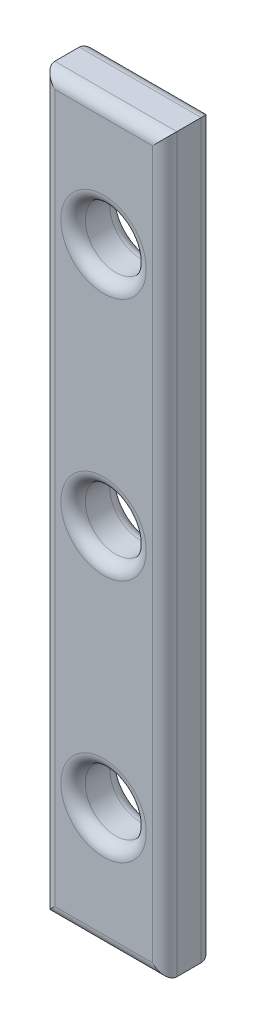
ISO-10303-21;
HEADER;
FILE_DESCRIPTION(('STEP AP214'),'2;1');
FILE_NAME('part.step','',(''),(''),'','','');
FILE_SCHEMA(('AUTOMOTIVE_DESIGN { 1 0 10303 214 1 1 1 1 }'));
ENDSEC;
DATA;
#1=APPLICATION_CONTEXT('core data for automotive mechanical design processes');
#2=APPLICATION_PROTOCOL_DEFINITION('international standard','automotive_design',2000,#1);
#3=PRODUCT_CONTEXT('',#1,'mechanical');
#4=PRODUCT('Part','Part','',(#3));
#5=PRODUCT_RELATED_PRODUCT_CATEGORY('part','',(#4));
#6=PRODUCT_DEFINITION_FORMATION('','',#4);
#7=PRODUCT_DEFINITION_CONTEXT('part definition',#1,'design');
#8=PRODUCT_DEFINITION('design','',#6,#7);
#9=PRODUCT_DEFINITION_SHAPE('','',#8);
#10=(LENGTH_UNIT() NAMED_UNIT(*) SI_UNIT(.MILLI.,.METRE.));
#11=(NAMED_UNIT(*) PLANE_ANGLE_UNIT() SI_UNIT($,.RADIAN.));
#12=(NAMED_UNIT(*) SI_UNIT($,.STERADIAN.) SOLID_ANGLE_UNIT());
#13=UNCERTAINTY_MEASURE_WITH_UNIT(LENGTH_MEASURE(1.E-05),#10,'distance_accuracy_value','');
#14=(GEOMETRIC_REPRESENTATION_CONTEXT(3) GLOBAL_UNCERTAINTY_ASSIGNED_CONTEXT((#13)) GLOBAL_UNIT_ASSIGNED_CONTEXT((#10,
#11,#12)) REPRESENTATION_CONTEXT('',''));
#15=CARTESIAN_POINT('',(0.,0.,0.));
#16=DIRECTION('',(0.,0.,1.));
#17=DIRECTION('',(1.,0.,0.));
#18=AXIS2_PLACEMENT_3D('',#15,#16,#17);
#19=CARTESIAN_POINT('',(0.,0.,4.));
#20=DIRECTION('',(0.,0.,-1.));
#21=DIRECTION('',(-1.,0.,0.));
#22=AXIS2_PLACEMENT_3D('',#19,#20,#21);
#23=PLANE('',#22);
#24=CARTESIAN_POINT('',(5.,30.,4.));
#25=DIRECTION('',(0.,0.,-1.));
#26=DIRECTION('',(-1.,0.,0.));
#27=AXIS2_PLACEMENT_3D('',#24,#25,#26);
#28=CIRCLE('',#27,3.5);
#29=CARTESIAN_POINT('',(1.5,30.,4.));
#30=VERTEX_POINT('',#29);
#31=EDGE_CURVE('E204',#30,#30,#28,.T.);
#32=ORIENTED_EDGE('',*,*,#31,.T.);
#33=EDGE_LOOP('',(#32));
#34=FACE_BOUND('',#33,.T.);
#35=CARTESIAN_POINT('',(5.,10.,4.));
#36=DIRECTION('',(0.,0.,-1.));
#37=DIRECTION('',(-1.,0.,0.));
#38=AXIS2_PLACEMENT_3D('',#35,#36,#37);
#39=CIRCLE('',#38,3.5);
#40=CARTESIAN_POINT('',(1.5,10.,4.));
#41=VERTEX_POINT('',#40);
#42=EDGE_CURVE('E200',#41,#41,#39,.T.);
#43=ORIENTED_EDGE('',*,*,#42,.T.);
#44=EDGE_LOOP('',(#43));
#45=FACE_BOUND('',#44,.T.);
#46=CARTESIAN_POINT('',(5.,50.,4.));
#47=DIRECTION('',(0.,0.,-1.));
#48=DIRECTION('',(-1.,0.,0.));
#49=AXIS2_PLACEMENT_3D('',#46,#47,#48);
#50=CIRCLE('',#49,3.5);
#51=CARTESIAN_POINT('',(1.5,50.,4.));
#52=VERTEX_POINT('',#51);
#53=EDGE_CURVE('E196',#52,#52,#50,.T.);
#54=ORIENTED_EDGE('',*,*,#53,.T.);
#55=EDGE_LOOP('',(#54));
#56=FACE_BOUND('',#55,.T.);
#57=DIRECTION('',(0.,-1.,0.));
#58=VECTOR('',#57,1.);
#59=CARTESIAN_POINT('',(1.,0.,4.));
#60=LINE('',#59,#58);
#61=CARTESIAN_POINT('',(1.,59.,4.));
#62=VERTEX_POINT('',#61);
#63=CARTESIAN_POINT('',(1.,1.,4.));
#64=VERTEX_POINT('',#63);
#65=EDGE_CURVE('E119',#62,#64,#60,.T.);
#66=ORIENTED_EDGE('',*,*,#65,.T.);
#67=DIRECTION('',(1.,0.,0.));
#68=VECTOR('',#67,1.);
#69=CARTESIAN_POINT('',(0.,1.,4.));
#70=LINE('',#69,#68);
#71=CARTESIAN_POINT('',(9.,1.,4.));
#72=VERTEX_POINT('',#71);
#73=EDGE_CURVE('E114',#64,#72,#70,.T.);
#74=ORIENTED_EDGE('',*,*,#73,.T.);
#75=DIRECTION('',(0.,1.,0.));
#76=VECTOR('',#75,1.);
#77=CARTESIAN_POINT('',(9.,0.,4.));
#78=LINE('',#77,#76);
#79=CARTESIAN_POINT('',(9.,59.,4.));
#80=VERTEX_POINT('',#79);
#81=EDGE_CURVE('E110',#72,#80,#78,.T.);
#82=ORIENTED_EDGE('',*,*,#81,.T.);
#83=DIRECTION('',(-1.,0.,0.));
#84=VECTOR('',#83,1.);
#85=CARTESIAN_POINT('',(0.,59.,4.));
#86=LINE('',#85,#84);
#87=EDGE_CURVE('E112',#80,#62,#86,.T.);
#88=ORIENTED_EDGE('',*,*,#87,.T.);
#89=EDGE_LOOP('',(#66,#74,#82,#88));
#90=FACE_BOUND('',#89,.T.);
#91=ADVANCED_FACE('F40',(#34,#45,#56,#90),#23,.F.);
#92=CARTESIAN_POINT('',(0.,0.,0.));
#93=DIRECTION('',(0.,0.,-1.));
#94=DIRECTION('',(-1.,0.,0.));
#95=AXIS2_PLACEMENT_3D('',#92,#93,#94);
#96=PLANE('',#95);
#97=CARTESIAN_POINT('',(5.,30.,0.));
#98=DIRECTION('',(0.,0.,-1.));
#99=DIRECTION('',(-1.,0.,0.));
#100=AXIS2_PLACEMENT_3D('',#97,#98,#99);
#101=CIRCLE('',#100,3.5);
#102=CARTESIAN_POINT('',(1.5,30.,0.));
#103=VERTEX_POINT('',#102);
#104=EDGE_CURVE('E49',#103,#103,#101,.F.);
#105=ORIENTED_EDGE('',*,*,#104,.T.);
#106=EDGE_LOOP('',(#105));
#107=FACE_BOUND('',#106,.T.);
#108=CARTESIAN_POINT('',(5.,50.,0.));
#109=DIRECTION('',(0.,0.,-1.));
#110=DIRECTION('',(-1.,0.,0.));
#111=AXIS2_PLACEMENT_3D('',#108,#109,#110);
#112=CIRCLE('',#111,3.5);
#113=CARTESIAN_POINT('',(1.5,50.,0.));
#114=VERTEX_POINT('',#113);
#115=EDGE_CURVE('E232',#114,#114,#112,.F.);
#116=ORIENTED_EDGE('',*,*,#115,.T.);
#117=EDGE_LOOP('',(#116));
#118=FACE_BOUND('',#117,.T.);
#119=CARTESIAN_POINT('',(5.,10.,0.));
#120=DIRECTION('',(0.,0.,-1.));
#121=DIRECTION('',(-1.,0.,0.));
#122=AXIS2_PLACEMENT_3D('',#119,#120,#121);
#123=CIRCLE('',#122,3.5);
#124=CARTESIAN_POINT('',(1.5,10.,0.));
#125=VERTEX_POINT('',#124);
#126=EDGE_CURVE('E228',#125,#125,#123,.F.);
#127=ORIENTED_EDGE('',*,*,#126,.T.);
#128=EDGE_LOOP('',(#127));
#129=FACE_BOUND('',#128,.T.);
#130=DIRECTION('',(0.,-1.,0.));
#131=VECTOR('',#130,1.);
#132=CARTESIAN_POINT('',(1.,60.,0.));
#133=LINE('',#132,#131);
#134=CARTESIAN_POINT('',(1.,1.,0.));
#135=VERTEX_POINT('',#134);
#136=CARTESIAN_POINT('',(1.,59.,0.));
#137=VERTEX_POINT('',#136);
#138=EDGE_CURVE('E218',#135,#137,#133,.F.);
#139=ORIENTED_EDGE('',*,*,#138,.T.);
#140=DIRECTION('',(-1.,0.,0.));
#141=VECTOR('',#140,1.);
#142=CARTESIAN_POINT('',(10.,59.,0.));
#143=LINE('',#142,#141);
#144=CARTESIAN_POINT('',(9.,59.,0.));
#145=VERTEX_POINT('',#144);
#146=EDGE_CURVE('E224',#137,#145,#143,.F.);
#147=ORIENTED_EDGE('',*,*,#146,.T.);
#148=DIRECTION('',(0.,1.,0.));
#149=VECTOR('',#148,1.);
#150=CARTESIAN_POINT('',(9.,0.,0.));
#151=LINE('',#150,#149);
#152=CARTESIAN_POINT('',(9.,1.,0.));
#153=VERTEX_POINT('',#152);
#154=EDGE_CURVE('E221',#145,#153,#151,.F.);
#155=ORIENTED_EDGE('',*,*,#154,.T.);
#156=DIRECTION('',(1.,0.,0.));
#157=VECTOR('',#156,1.);
#158=CARTESIAN_POINT('',(0.,1.,0.));
#159=LINE('',#158,#157);
#160=EDGE_CURVE('E215',#153,#135,#159,.F.);
#161=ORIENTED_EDGE('',*,*,#160,.T.);
#162=EDGE_LOOP('',(#139,#147,#155,#161));
#163=FACE_BOUND('',#162,.T.);
#164=ADVANCED_FACE('F271',(#107,#118,#129,#163),#96,.T.);
#165=CARTESIAN_POINT('',(0.,0.,4.));
#166=DIRECTION('',(1.,0.,0.));
#167=DIRECTION('',(0.,0.,-1.));
#168=AXIS2_PLACEMENT_3D('',#165,#166,#167);
#169=PLANE('',#168);
#170=DIRECTION('',(0.,0.,-1.));
#171=VECTOR('',#170,1.);
#172=CARTESIAN_POINT('',(0.,60.,4.));
#173=LINE('',#172,#171);
#174=CARTESIAN_POINT('',(0.,60.,3.));
#175=VERTEX_POINT('',#174);
#176=CARTESIAN_POINT('',(0.,60.,1.));
#177=VERTEX_POINT('',#176);
#178=EDGE_CURVE('E173',#175,#177,#173,.T.);
#179=ORIENTED_EDGE('',*,*,#178,.T.);
#180=DIRECTION('',(0.,-1.,0.));
#181=VECTOR('',#180,1.);
#182=CARTESIAN_POINT('',(0.,0.,1.));
#183=LINE('',#182,#181);
#184=CARTESIAN_POINT('',(0.,0.,1.));
#185=VERTEX_POINT('',#184);
#186=EDGE_CURVE('E56',#177,#185,#183,.T.);
#187=ORIENTED_EDGE('',*,*,#186,.T.);
#188=DIRECTION('',(0.,0.,-1.));
#189=VECTOR('',#188,1.);
#190=CARTESIAN_POINT('',(0.,0.,4.));
#191=LINE('',#190,#189);
#192=CARTESIAN_POINT('',(0.,0.,3.));
#193=VERTEX_POINT('',#192);
#194=EDGE_CURVE('E177',#193,#185,#191,.T.);
#195=ORIENTED_EDGE('',*,*,#194,.F.);
#196=DIRECTION('',(0.,-1.,0.));
#197=VECTOR('',#196,1.);
#198=CARTESIAN_POINT('',(0.,0.,3.));
#199=LINE('',#198,#197);
#200=EDGE_CURVE('E180',#193,#175,#199,.F.);
#201=ORIENTED_EDGE('',*,*,#200,.T.);
#202=EDGE_LOOP('',(#179,#187,#195,#201));
#203=FACE_BOUND('',#202,.T.);
#204=ADVANCED_FACE('F179',(#203),#169,.F.);
#205=CARTESIAN_POINT('',(0.,0.,4.));
#206=DIRECTION('',(0.,1.,0.));
#207=DIRECTION('',(0.,0.,1.));
#208=AXIS2_PLACEMENT_3D('',#205,#206,#207);
#209=PLANE('',#208);
#210=ORIENTED_EDGE('',*,*,#194,.T.);
#211=DIRECTION('',(1.,0.,0.));
#212=VECTOR('',#211,1.);
#213=CARTESIAN_POINT('',(10.,0.,1.));
#214=LINE('',#213,#212);
#215=CARTESIAN_POINT('',(10.,0.,1.));
#216=VERTEX_POINT('',#215);
#217=EDGE_CURVE('E146',#185,#216,#214,.T.);
#218=ORIENTED_EDGE('',*,*,#217,.T.);
#219=DIRECTION('',(0.,0.,-1.));
#220=VECTOR('',#219,1.);
#221=CARTESIAN_POINT('',(10.,0.,4.));
#222=LINE('',#221,#220);
#223=CARTESIAN_POINT('',(10.,0.,3.));
#224=VERTEX_POINT('',#223);
#225=EDGE_CURVE('E178',#224,#216,#222,.T.);
#226=ORIENTED_EDGE('',*,*,#225,.F.);
#227=DIRECTION('',(1.,0.,0.));
#228=VECTOR('',#227,1.);
#229=CARTESIAN_POINT('',(0.,0.,3.));
#230=LINE('',#229,#228);
#231=EDGE_CURVE('E150',#224,#193,#230,.F.);
#232=ORIENTED_EDGE('',*,*,#231,.T.);
#233=EDGE_LOOP('',(#210,#218,#226,#232));
#234=FACE_BOUND('',#233,.T.);
#235=ADVANCED_FACE('F176',(#234),#209,.F.);
#236=CARTESIAN_POINT('',(10.,0.,4.));
#237=DIRECTION('',(-1.,0.,0.));
#238=DIRECTION('',(0.,0.,1.));
#239=AXIS2_PLACEMENT_3D('',#236,#237,#238);
#240=PLANE('',#239);
#241=ORIENTED_EDGE('',*,*,#225,.T.);
#242=DIRECTION('',(0.,1.,0.));
#243=VECTOR('',#242,1.);
#244=CARTESIAN_POINT('',(10.,60.,1.));
#245=LINE('',#244,#243);
#246=CARTESIAN_POINT('',(10.,60.,1.));
#247=VERTEX_POINT('',#246);
#248=EDGE_CURVE('E246',#216,#247,#245,.T.);
#249=ORIENTED_EDGE('',*,*,#248,.T.);
#250=DIRECTION('',(0.,0.,-1.));
#251=VECTOR('',#250,1.);
#252=CARTESIAN_POINT('',(10.,60.,4.));
#253=LINE('',#252,#251);
#254=CARTESIAN_POINT('',(10.,60.,3.));
#255=VERTEX_POINT('',#254);
#256=EDGE_CURVE('E188',#255,#247,#253,.T.);
#257=ORIENTED_EDGE('',*,*,#256,.F.);
#258=DIRECTION('',(0.,1.,0.));
#259=VECTOR('',#258,1.);
#260=CARTESIAN_POINT('',(10.,0.,3.));
#261=LINE('',#260,#259);
#262=EDGE_CURVE('E134',#255,#224,#261,.F.);
#263=ORIENTED_EDGE('',*,*,#262,.T.);
#264=EDGE_LOOP('',(#241,#249,#257,#263));
#265=FACE_BOUND('',#264,.T.);
#266=ADVANCED_FACE('F325',(#265),#240,.F.);
#267=CARTESIAN_POINT('',(0.,60.,4.));
#268=DIRECTION('',(0.,-1.,0.));
#269=DIRECTION('',(0.,0.,-1.));
#270=AXIS2_PLACEMENT_3D('',#267,#268,#269);
#271=PLANE('',#270);
#272=ORIENTED_EDGE('',*,*,#256,.T.);
#273=DIRECTION('',(-1.,0.,0.));
#274=VECTOR('',#273,1.);
#275=CARTESIAN_POINT('',(0.,60.,1.));
#276=LINE('',#275,#274);
#277=EDGE_CURVE('E211',#247,#177,#276,.T.);
#278=ORIENTED_EDGE('',*,*,#277,.T.);
#279=ORIENTED_EDGE('',*,*,#178,.F.);
#280=DIRECTION('',(-1.,0.,0.));
#281=VECTOR('',#280,1.);
#282=CARTESIAN_POINT('',(0.,60.,3.));
#283=LINE('',#282,#281);
#284=EDGE_CURVE('E208',#175,#255,#283,.F.);
#285=ORIENTED_EDGE('',*,*,#284,.T.);
#286=EDGE_LOOP('',(#272,#278,#279,#285));
#287=FACE_BOUND('',#286,.T.);
#288=ADVANCED_FACE('F289',(#287),#271,.F.);
#289=CARTESIAN_POINT('',(5.,30.,4.));
#290=DIRECTION('',(0.,0.,-1.));
#291=DIRECTION('',(-1.,0.,0.));
#292=AXIS2_PLACEMENT_3D('',#289,#290,#291);
#293=CYLINDRICAL_SURFACE('',#292,2.5);
#294=CARTESIAN_POINT('',(5.,30.,1.));
#295=DIRECTION('',(0.,0.,-1.));
#296=DIRECTION('',(-1.,0.,0.));
#297=AXIS2_PLACEMENT_3D('',#294,#295,#296);
#298=CIRCLE('',#297,2.5);
#299=CARTESIAN_POINT('',(2.5,30.,1.));
#300=VERTEX_POINT('',#299);
#301=EDGE_CURVE('E11',#300,#300,#298,.T.);
#302=ORIENTED_EDGE('',*,*,#301,.T.);
#303=EDGE_LOOP('',(#302));
#304=FACE_BOUND('',#303,.T.);
#305=CARTESIAN_POINT('',(5.,30.,3.));
#306=DIRECTION('',(0.,0.,-1.));
#307=DIRECTION('',(-1.,0.,0.));
#308=AXIS2_PLACEMENT_3D('',#305,#306,#307);
#309=CIRCLE('',#308,2.5);
#310=CARTESIAN_POINT('',(2.5,30.,3.));
#311=VERTEX_POINT('',#310);
#312=EDGE_CURVE('E131',#311,#311,#309,.F.);
#313=ORIENTED_EDGE('',*,*,#312,.T.);
#314=EDGE_LOOP('',(#313));
#315=FACE_BOUND('',#314,.T.);
#316=ADVANCED_FACE('F320',(#304,#315),#293,.F.);
#317=CARTESIAN_POINT('',(5.,50.,4.));
#318=DIRECTION('',(0.,0.,-1.));
#319=DIRECTION('',(-1.,0.,0.));
#320=AXIS2_PLACEMENT_3D('',#317,#318,#319);
#321=CYLINDRICAL_SURFACE('',#320,2.5);
#322=CARTESIAN_POINT('',(5.,50.,1.));
#323=DIRECTION('',(0.,0.,-1.));
#324=DIRECTION('',(-1.,0.,0.));
#325=AXIS2_PLACEMENT_3D('',#322,#323,#324);
#326=CIRCLE('',#325,2.5);
#327=CARTESIAN_POINT('',(2.5,50.,1.));
#328=VERTEX_POINT('',#327);
#329=EDGE_CURVE('E240',#328,#328,#326,.T.);
#330=ORIENTED_EDGE('',*,*,#329,.T.);
#331=EDGE_LOOP('',(#330));
#332=FACE_BOUND('',#331,.T.);
#333=CARTESIAN_POINT('',(5.,50.,3.));
#334=DIRECTION('',(0.,0.,-1.));
#335=DIRECTION('',(-1.,0.,0.));
#336=AXIS2_PLACEMENT_3D('',#333,#334,#335);
#337=CIRCLE('',#336,2.5);
#338=CARTESIAN_POINT('',(2.5,50.,3.));
#339=VERTEX_POINT('',#338);
#340=EDGE_CURVE('E236',#339,#339,#337,.F.);
#341=ORIENTED_EDGE('',*,*,#340,.T.);
#342=EDGE_LOOP('',(#341));
#343=FACE_BOUND('',#342,.T.);
#344=ADVANCED_FACE('F406',(#332,#343),#321,.F.);
#345=CARTESIAN_POINT('',(5.,10.,4.));
#346=DIRECTION('',(0.,0.,-1.));
#347=DIRECTION('',(-1.,0.,0.));
#348=AXIS2_PLACEMENT_3D('',#345,#346,#347);
#349=CYLINDRICAL_SURFACE('',#348,2.5);
#350=CARTESIAN_POINT('',(5.,10.,1.));
#351=DIRECTION('',(0.,0.,-1.));
#352=DIRECTION('',(-1.,0.,0.));
#353=AXIS2_PLACEMENT_3D('',#350,#351,#352);
#354=CIRCLE('',#353,2.5);
#355=CARTESIAN_POINT('',(2.5,10.,1.));
#356=VERTEX_POINT('',#355);
#357=EDGE_CURVE('E253',#356,#356,#354,.T.);
#358=ORIENTED_EDGE('',*,*,#357,.T.);
#359=EDGE_LOOP('',(#358));
#360=FACE_BOUND('',#359,.T.);
#361=CARTESIAN_POINT('',(5.,10.,3.));
#362=DIRECTION('',(0.,0.,-1.));
#363=DIRECTION('',(-1.,0.,0.));
#364=AXIS2_PLACEMENT_3D('',#361,#362,#363);
#365=CIRCLE('',#364,2.5);
#366=CARTESIAN_POINT('',(2.5,10.,3.));
#367=VERTEX_POINT('',#366);
#368=EDGE_CURVE('E249',#367,#367,#365,.F.);
#369=ORIENTED_EDGE('',*,*,#368,.T.);
#370=EDGE_LOOP('',(#369));
#371=FACE_BOUND('',#370,.T.);
#372=ADVANCED_FACE('F261',(#360,#371),#349,.F.);
#373=CARTESIAN_POINT('',(5.,30.,3.));
#374=DIRECTION('',(0.,0.,-1.));
#375=DIRECTION('',(-1.,0.,0.));
#376=AXIS2_PLACEMENT_3D('',#373,#374,#375);
#377=TOROIDAL_SURFACE('',#376,3.5,1.);
#378=ORIENTED_EDGE('',*,*,#31,.F.);
#379=EDGE_LOOP('',(#378));
#380=FACE_BOUND('',#379,.T.);
#381=ORIENTED_EDGE('',*,*,#312,.F.);
#382=EDGE_LOOP('',(#381));
#383=FACE_BOUND('',#382,.T.);
#384=ADVANCED_FACE('F302',(#380,#383),#377,.T.);
#385=CARTESIAN_POINT('',(0.,1.,1.));
#386=DIRECTION('',(-1.,0.,0.));
#387=DIRECTION('',(0.,0.,1.));
#388=AXIS2_PLACEMENT_3D('',#385,#386,#387);
#389=CYLINDRICAL_SURFACE('',#388,1.);
#390=CARTESIAN_POINT('',(1.,1.,1.));
#391=DIRECTION('',(-0.707106781186547,0.707106781186547,0.));
#392=DIRECTION('',(-0.707106781186547,-0.707106781186547,0.));
#393=AXIS2_PLACEMENT_3D('',#390,#391,#392);
#394=ELLIPSE('',#393,1.41421356237309,1.);
#395=EDGE_CURVE('E166',#135,#185,#394,.T.);
#396=ORIENTED_EDGE('',*,*,#395,.F.);
#397=ORIENTED_EDGE('',*,*,#160,.F.);
#398=CARTESIAN_POINT('',(9.,1.,1.));
#399=DIRECTION('',(-0.707106781186547,-0.707106781186547,0.));
#400=DIRECTION('',(-0.707106781186547,0.707106781186547,0.));
#401=AXIS2_PLACEMENT_3D('',#398,#399,#400);
#402=ELLIPSE('',#401,1.41421356237309,1.);
#403=EDGE_CURVE('E170',#216,#153,#402,.F.);
#404=ORIENTED_EDGE('',*,*,#403,.F.);
#405=ORIENTED_EDGE('',*,*,#217,.F.);
#406=EDGE_LOOP('',(#396,#397,#404,#405));
#407=FACE_BOUND('',#406,.T.);
#408=ADVANCED_FACE('F300',(#407),#389,.T.);
#409=CARTESIAN_POINT('',(9.,0.,1.));
#410=DIRECTION('',(0.,-1.,0.));
#411=DIRECTION('',(0.,0.,-1.));
#412=AXIS2_PLACEMENT_3D('',#409,#410,#411);
#413=CYLINDRICAL_SURFACE('',#412,1.);
#414=ORIENTED_EDGE('',*,*,#403,.T.);
#415=ORIENTED_EDGE('',*,*,#154,.F.);
#416=CARTESIAN_POINT('',(9.,59.,1.));
#417=DIRECTION('',(0.707106781186547,-0.707106781186547,0.));
#418=DIRECTION('',(-0.707106781186547,-0.707106781186547,0.));
#419=AXIS2_PLACEMENT_3D('',#416,#417,#418);
#420=ELLIPSE('',#419,1.41421356237309,1.);
#421=EDGE_CURVE('E163',#247,#145,#420,.F.);
#422=ORIENTED_EDGE('',*,*,#421,.F.);
#423=ORIENTED_EDGE('',*,*,#248,.F.);
#424=EDGE_LOOP('',(#414,#415,#422,#423));
#425=FACE_BOUND('',#424,.T.);
#426=ADVANCED_FACE('F297',(#425),#413,.T.);
#427=CARTESIAN_POINT('',(1.,0.,1.));
#428=DIRECTION('',(0.,1.,0.));
#429=DIRECTION('',(0.,0.,1.));
#430=AXIS2_PLACEMENT_3D('',#427,#428,#429);
#431=CYLINDRICAL_SURFACE('',#430,1.);
#432=ORIENTED_EDGE('',*,*,#395,.T.);
#433=ORIENTED_EDGE('',*,*,#186,.F.);
#434=CARTESIAN_POINT('',(1.,59.,1.));
#435=DIRECTION('',(0.707106781186547,0.707106781186547,0.));
#436=DIRECTION('',(-0.707106781186547,0.707106781186547,0.));
#437=AXIS2_PLACEMENT_3D('',#434,#435,#436);
#438=ELLIPSE('',#437,1.41421356237309,1.);
#439=EDGE_CURVE('E139',#137,#177,#438,.T.);
#440=ORIENTED_EDGE('',*,*,#439,.F.);
#441=ORIENTED_EDGE('',*,*,#138,.F.);
#442=EDGE_LOOP('',(#432,#433,#440,#441));
#443=FACE_BOUND('',#442,.T.);
#444=ADVANCED_FACE('F286',(#443),#431,.T.);
#445=CARTESIAN_POINT('',(0.,59.,1.));
#446=DIRECTION('',(1.,0.,0.));
#447=DIRECTION('',(0.,0.,-1.));
#448=AXIS2_PLACEMENT_3D('',#445,#446,#447);
#449=CYLINDRICAL_SURFACE('',#448,1.);
#450=ORIENTED_EDGE('',*,*,#421,.T.);
#451=ORIENTED_EDGE('',*,*,#146,.F.);
#452=ORIENTED_EDGE('',*,*,#439,.T.);
#453=ORIENTED_EDGE('',*,*,#277,.F.);
#454=EDGE_LOOP('',(#450,#451,#452,#453));
#455=FACE_BOUND('',#454,.T.);
#456=ADVANCED_FACE('F282',(#455),#449,.T.);
#457=CARTESIAN_POINT('',(5.,50.,1.));
#458=DIRECTION('',(0.,0.,-1.));
#459=DIRECTION('',(-1.,0.,0.));
#460=AXIS2_PLACEMENT_3D('',#457,#458,#459);
#461=TOROIDAL_SURFACE('',#460,3.5,1.);
#462=ORIENTED_EDGE('',*,*,#329,.F.);
#463=EDGE_LOOP('',(#462));
#464=FACE_BOUND('',#463,.T.);
#465=ORIENTED_EDGE('',*,*,#115,.F.);
#466=EDGE_LOOP('',(#465));
#467=FACE_BOUND('',#466,.T.);
#468=ADVANCED_FACE('F267',(#464,#467),#461,.T.);
#469=CARTESIAN_POINT('',(5.,10.,1.));
#470=DIRECTION('',(0.,0.,-1.));
#471=DIRECTION('',(-1.,0.,0.));
#472=AXIS2_PLACEMENT_3D('',#469,#470,#471);
#473=TOROIDAL_SURFACE('',#472,3.5,1.);
#474=ORIENTED_EDGE('',*,*,#357,.F.);
#475=EDGE_LOOP('',(#474));
#476=FACE_BOUND('',#475,.T.);
#477=ORIENTED_EDGE('',*,*,#126,.F.);
#478=EDGE_LOOP('',(#477));
#479=FACE_BOUND('',#478,.T.);
#480=ADVANCED_FACE('F264',(#476,#479),#473,.T.);
#481=CARTESIAN_POINT('',(0.,59.,3.));
#482=DIRECTION('',(-1.,0.,0.));
#483=DIRECTION('',(0.,0.,1.));
#484=AXIS2_PLACEMENT_3D('',#481,#482,#483);
#485=CYLINDRICAL_SURFACE('',#484,1.);
#486=CARTESIAN_POINT('',(9.,59.,3.));
#487=DIRECTION('',(-0.707106781186547,0.707106781186547,0.));
#488=DIRECTION('',(-0.707106781186547,-0.707106781186547,0.));
#489=AXIS2_PLACEMENT_3D('',#486,#487,#488);
#490=ELLIPSE('',#489,1.41421356237309,1.);
#491=EDGE_CURVE('E125',#255,#80,#490,.F.);
#492=ORIENTED_EDGE('',*,*,#491,.F.);
#493=ORIENTED_EDGE('',*,*,#284,.F.);
#494=CARTESIAN_POINT('',(1.,59.,3.));
#495=DIRECTION('',(-0.707106781186547,-0.707106781186547,0.));
#496=DIRECTION('',(-0.707106781186547,0.707106781186547,0.));
#497=AXIS2_PLACEMENT_3D('',#494,#495,#496);
#498=ELLIPSE('',#497,1.41421356237309,1.);
#499=EDGE_CURVE('E128',#62,#175,#498,.T.);
#500=ORIENTED_EDGE('',*,*,#499,.F.);
#501=ORIENTED_EDGE('',*,*,#87,.F.);
#502=EDGE_LOOP('',(#492,#493,#500,#501));
#503=FACE_BOUND('',#502,.T.);
#504=ADVANCED_FACE('F123',(#503),#485,.T.);
#505=CARTESIAN_POINT('',(1.,0.,3.));
#506=DIRECTION('',(0.,-1.,0.));
#507=DIRECTION('',(0.,0.,-1.));
#508=AXIS2_PLACEMENT_3D('',#505,#506,#507);
#509=CYLINDRICAL_SURFACE('',#508,1.);
#510=ORIENTED_EDGE('',*,*,#499,.T.);
#511=ORIENTED_EDGE('',*,*,#200,.F.);
#512=CARTESIAN_POINT('',(1.,1.,3.));
#513=DIRECTION('',(0.707106781186547,-0.707106781186547,0.));
#514=DIRECTION('',(-0.707106781186547,-0.707106781186547,0.));
#515=AXIS2_PLACEMENT_3D('',#512,#513,#514);
#516=ELLIPSE('',#515,1.41421356237309,1.);
#517=EDGE_CURVE('E64',#64,#193,#516,.T.);
#518=ORIENTED_EDGE('',*,*,#517,.F.);
#519=ORIENTED_EDGE('',*,*,#65,.F.);
#520=EDGE_LOOP('',(#510,#511,#518,#519));
#521=FACE_BOUND('',#520,.T.);
#522=ADVANCED_FACE('F358',(#521),#509,.T.);
#523=CARTESIAN_POINT('',(9.,0.,3.));
#524=DIRECTION('',(0.,1.,0.));
#525=DIRECTION('',(0.,0.,1.));
#526=AXIS2_PLACEMENT_3D('',#523,#524,#525);
#527=CYLINDRICAL_SURFACE('',#526,1.);
#528=ORIENTED_EDGE('',*,*,#491,.T.);
#529=ORIENTED_EDGE('',*,*,#81,.F.);
#530=CARTESIAN_POINT('',(9.,1.,3.));
#531=DIRECTION('',(0.707106781186547,0.707106781186547,0.));
#532=DIRECTION('',(-0.707106781186547,0.707106781186547,0.));
#533=AXIS2_PLACEMENT_3D('',#530,#531,#532);
#534=ELLIPSE('',#533,1.41421356237309,1.);
#535=EDGE_CURVE('E141',#224,#72,#534,.F.);
#536=ORIENTED_EDGE('',*,*,#535,.F.);
#537=ORIENTED_EDGE('',*,*,#262,.F.);
#538=EDGE_LOOP('',(#528,#529,#536,#537));
#539=FACE_BOUND('',#538,.T.);
#540=ADVANCED_FACE('F133',(#539),#527,.T.);
#541=CARTESIAN_POINT('',(0.,1.,3.));
#542=DIRECTION('',(1.,0.,0.));
#543=DIRECTION('',(0.,0.,-1.));
#544=AXIS2_PLACEMENT_3D('',#541,#542,#543);
#545=CYLINDRICAL_SURFACE('',#544,1.);
#546=ORIENTED_EDGE('',*,*,#517,.T.);
#547=ORIENTED_EDGE('',*,*,#231,.F.);
#548=ORIENTED_EDGE('',*,*,#535,.T.);
#549=ORIENTED_EDGE('',*,*,#73,.F.);
#550=EDGE_LOOP('',(#546,#547,#548,#549));
#551=FACE_BOUND('',#550,.T.);
#552=ADVANCED_FACE('F175',(#551),#545,.T.);
#553=CARTESIAN_POINT('',(5.,10.,3.));
#554=DIRECTION('',(0.,0.,-1.));
#555=DIRECTION('',(-1.,0.,0.));
#556=AXIS2_PLACEMENT_3D('',#553,#554,#555);
#557=TOROIDAL_SURFACE('',#556,3.5,1.);
#558=ORIENTED_EDGE('',*,*,#42,.F.);
#559=EDGE_LOOP('',(#558));
#560=FACE_BOUND('',#559,.T.);
#561=ORIENTED_EDGE('',*,*,#368,.F.);
#562=EDGE_LOOP('',(#561));
#563=FACE_BOUND('',#562,.T.);
#564=ADVANCED_FACE('F378',(#560,#563),#557,.T.);
#565=CARTESIAN_POINT('',(5.,50.,3.));
#566=DIRECTION('',(0.,0.,-1.));
#567=DIRECTION('',(-1.,0.,0.));
#568=AXIS2_PLACEMENT_3D('',#565,#566,#567);
#569=TOROIDAL_SURFACE('',#568,3.5,1.);
#570=ORIENTED_EDGE('',*,*,#53,.F.);
#571=EDGE_LOOP('',(#570));
#572=FACE_BOUND('',#571,.T.);
#573=ORIENTED_EDGE('',*,*,#340,.F.);
#574=EDGE_LOOP('',(#573));
#575=FACE_BOUND('',#574,.T.);
#576=ADVANCED_FACE('F385',(#572,#575),#569,.T.);
#577=CARTESIAN_POINT('',(5.,30.,1.));
#578=DIRECTION('',(0.,0.,-1.));
#579=DIRECTION('',(-1.,0.,0.));
#580=AXIS2_PLACEMENT_3D('',#577,#578,#579);
#581=TOROIDAL_SURFACE('',#580,3.5,1.);
#582=ORIENTED_EDGE('',*,*,#301,.F.);
#583=EDGE_LOOP('',(#582));
#584=FACE_BOUND('',#583,.T.);
#585=ORIENTED_EDGE('',*,*,#104,.F.);
#586=EDGE_LOOP('',(#585));
#587=FACE_BOUND('',#586,.T.);
#588=ADVANCED_FACE('F42',(#584,#587),#581,.T.);
#589=CLOSED_SHELL('',(#91,#164,#204,#235,#266,#288,#316,#344,#372,#384,#408,#426,#444,#456,#468,
#480,#504,#522,#540,#552,#564,#576,#588));
#590=MANIFOLD_SOLID_BREP('B2',#589);
#591=ADVANCED_BREP_SHAPE_REPRESENTATION('',(#18,#590),#14);
#592=SHAPE_DEFINITION_REPRESENTATION(#9,#591);
ENDSEC;
END-ISO-10303-21;
